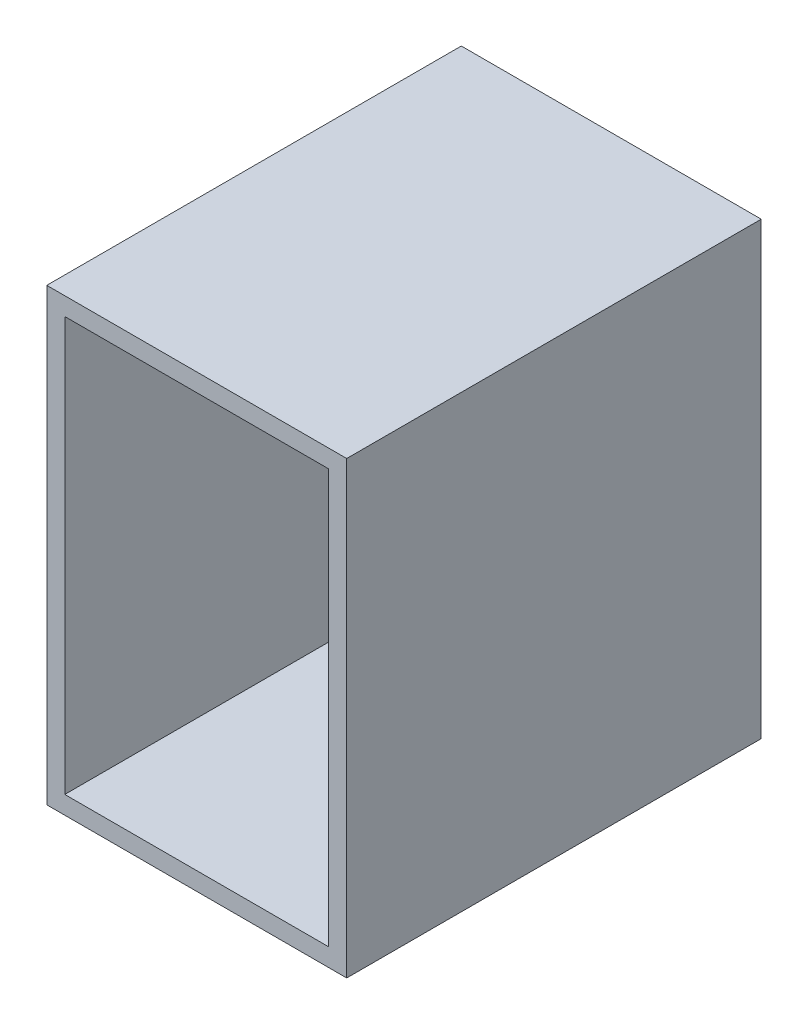
ISO-10303-21;
HEADER;
FILE_DESCRIPTION(('STEP AP214'),'2;1');
FILE_NAME('part.step','',(''),(''),'','','');
FILE_SCHEMA(('AUTOMOTIVE_DESIGN { 1 0 10303 214 1 1 1 1 }'));
ENDSEC;
DATA;
#1=APPLICATION_CONTEXT('core data for automotive mechanical design processes');
#2=APPLICATION_PROTOCOL_DEFINITION('international standard','automotive_design',2000,#1);
#3=PRODUCT_CONTEXT('',#1,'mechanical');
#4=PRODUCT('Part','Part','',(#3));
#5=PRODUCT_RELATED_PRODUCT_CATEGORY('part','',(#4));
#6=PRODUCT_DEFINITION_FORMATION('','',#4);
#7=PRODUCT_DEFINITION_CONTEXT('part definition',#1,'design');
#8=PRODUCT_DEFINITION('design','',#6,#7);
#9=PRODUCT_DEFINITION_SHAPE('','',#8);
#10=(LENGTH_UNIT() NAMED_UNIT(*) SI_UNIT(.MILLI.,.METRE.));
#11=(NAMED_UNIT(*) PLANE_ANGLE_UNIT() SI_UNIT($,.RADIAN.));
#12=(NAMED_UNIT(*) SI_UNIT($,.STERADIAN.) SOLID_ANGLE_UNIT());
#13=UNCERTAINTY_MEASURE_WITH_UNIT(LENGTH_MEASURE(1.E-05),#10,'distance_accuracy_value','');
#14=(GEOMETRIC_REPRESENTATION_CONTEXT(3) GLOBAL_UNCERTAINTY_ASSIGNED_CONTEXT((#13)) GLOBAL_UNIT_ASSIGNED_CONTEXT((#10,
#11,#12)) REPRESENTATION_CONTEXT('',''));
#15=CARTESIAN_POINT('',(0.,0.,0.));
#16=DIRECTION('',(0.,0.,1.));
#17=DIRECTION('',(1.,0.,0.));
#18=AXIS2_PLACEMENT_3D('',#15,#16,#17);
#19=CARTESIAN_POINT('',(0.,0.,138.202315188089));
#20=DIRECTION('',(0.,0.,-1.));
#21=DIRECTION('',(-1.,0.,0.));
#22=AXIS2_PLACEMENT_3D('',#19,#20,#21);
#23=PLANE('',#22);
#24=DIRECTION('',(0.,-1.,0.));
#25=VECTOR('',#24,1.);
#26=CARTESIAN_POINT('',(-50.,-75.,138.202315188089));
#27=LINE('',#26,#25);
#28=CARTESIAN_POINT('',(-50.,74.9999999999999,138.202315188089));
#29=VERTEX_POINT('',#28);
#30=CARTESIAN_POINT('',(-50.,-75.,138.202315188089));
#31=VERTEX_POINT('',#30);
#32=EDGE_CURVE('E138',#29,#31,#27,.T.);
#33=ORIENTED_EDGE('',*,*,#32,.T.);
#34=DIRECTION('',(1.,0.,0.));
#35=VECTOR('',#34,1.);
#36=CARTESIAN_POINT('',(-50.,-75.,138.202315188089));
#37=LINE('',#36,#35);
#38=CARTESIAN_POINT('',(50.,-75.,138.202315188089));
#39=VERTEX_POINT('',#38);
#40=EDGE_CURVE('E141',#31,#39,#37,.T.);
#41=ORIENTED_EDGE('',*,*,#40,.T.);
#42=DIRECTION('',(0.,1.,0.));
#43=VECTOR('',#42,1.);
#44=CARTESIAN_POINT('',(50.,-75.,138.202315188089));
#45=LINE('',#44,#43);
#46=CARTESIAN_POINT('',(50.,75.,138.202315188089));
#47=VERTEX_POINT('',#46);
#48=EDGE_CURVE('E148',#39,#47,#45,.T.);
#49=ORIENTED_EDGE('',*,*,#48,.T.);
#50=DIRECTION('',(-1.,0.,0.));
#51=VECTOR('',#50,1.);
#52=CARTESIAN_POINT('',(-50.,74.9999999999999,138.202315188089));
#53=LINE('',#52,#51);
#54=EDGE_CURVE('E146',#47,#29,#53,.T.);
#55=ORIENTED_EDGE('',*,*,#54,.T.);
#56=EDGE_LOOP('',(#33,#41,#49,#55));
#57=FACE_BOUND('',#56,.T.);
#58=DIRECTION('',(0.,-1.,0.));
#59=VECTOR('',#58,1.);
#60=CARTESIAN_POINT('',(-44.,-69.,138.202315188089));
#61=LINE('',#60,#59);
#62=CARTESIAN_POINT('',(-44.,69.,138.202315188089));
#63=VERTEX_POINT('',#62);
#64=CARTESIAN_POINT('',(-44.,-69.,138.202315188089));
#65=VERTEX_POINT('',#64);
#66=EDGE_CURVE('E102',#63,#65,#61,.T.);
#67=ORIENTED_EDGE('',*,*,#66,.F.);
#68=DIRECTION('',(-1.,0.,0.));
#69=VECTOR('',#68,1.);
#70=CARTESIAN_POINT('',(-44.,69.,138.202315188089));
#71=LINE('',#70,#69);
#72=CARTESIAN_POINT('',(44.,69.,138.202315188089));
#73=VERTEX_POINT('',#72);
#74=EDGE_CURVE('E127',#73,#63,#71,.T.);
#75=ORIENTED_EDGE('',*,*,#74,.F.);
#76=DIRECTION('',(0.,1.,0.));
#77=VECTOR('',#76,1.);
#78=CARTESIAN_POINT('',(44.,-69.,138.202315188089));
#79=LINE('',#78,#77);
#80=CARTESIAN_POINT('',(44.,-69.,138.202315188089));
#81=VERTEX_POINT('',#80);
#82=EDGE_CURVE('E121',#81,#73,#79,.T.);
#83=ORIENTED_EDGE('',*,*,#82,.F.);
#84=DIRECTION('',(1.,0.,0.));
#85=VECTOR('',#84,1.);
#86=CARTESIAN_POINT('',(-44.,-69.,138.202315188089));
#87=LINE('',#86,#85);
#88=EDGE_CURVE('E115',#65,#81,#87,.T.);
#89=ORIENTED_EDGE('',*,*,#88,.F.);
#90=EDGE_LOOP('',(#67,#75,#83,#89));
#91=FACE_BOUND('',#90,.T.);
#92=ADVANCED_FACE('F39',(#57,#91),#23,.F.);
#93=CARTESIAN_POINT('',(0.,0.,0.));
#94=DIRECTION('',(0.,0.,-1.));
#95=DIRECTION('',(-1.,0.,0.));
#96=AXIS2_PLACEMENT_3D('',#93,#94,#95);
#97=PLANE('',#96);
#98=DIRECTION('',(0.,-1.,0.));
#99=VECTOR('',#98,1.);
#100=CARTESIAN_POINT('',(-50.,-75.,0.));
#101=LINE('',#100,#99);
#102=CARTESIAN_POINT('',(-50.,74.9999999999999,0.));
#103=VERTEX_POINT('',#102);
#104=CARTESIAN_POINT('',(-50.,-75.,0.));
#105=VERTEX_POINT('',#104);
#106=EDGE_CURVE('E119',#103,#105,#101,.T.);
#107=ORIENTED_EDGE('',*,*,#106,.F.);
#108=DIRECTION('',(-1.,0.,0.));
#109=VECTOR('',#108,1.);
#110=CARTESIAN_POINT('',(-50.,74.9999999999999,0.));
#111=LINE('',#110,#109);
#112=CARTESIAN_POINT('',(50.,75.,0.));
#113=VERTEX_POINT('',#112);
#114=EDGE_CURVE('E145',#113,#103,#111,.T.);
#115=ORIENTED_EDGE('',*,*,#114,.F.);
#116=DIRECTION('',(0.,1.,0.));
#117=VECTOR('',#116,1.);
#118=CARTESIAN_POINT('',(50.,-75.,0.));
#119=LINE('',#118,#117);
#120=CARTESIAN_POINT('',(50.,-75.,0.));
#121=VERTEX_POINT('',#120);
#122=EDGE_CURVE('E154',#121,#113,#119,.T.);
#123=ORIENTED_EDGE('',*,*,#122,.F.);
#124=DIRECTION('',(1.,0.,0.));
#125=VECTOR('',#124,1.);
#126=CARTESIAN_POINT('',(-50.,-75.,0.));
#127=LINE('',#126,#125);
#128=EDGE_CURVE('E153',#105,#121,#127,.T.);
#129=ORIENTED_EDGE('',*,*,#128,.F.);
#130=EDGE_LOOP('',(#107,#115,#123,#129));
#131=FACE_BOUND('',#130,.T.);
#132=DIRECTION('',(-1.,0.,0.));
#133=VECTOR('',#132,1.);
#134=CARTESIAN_POINT('',(-44.,69.,0.));
#135=LINE('',#134,#133);
#136=CARTESIAN_POINT('',(44.,69.,0.));
#137=VERTEX_POINT('',#136);
#138=CARTESIAN_POINT('',(-44.,69.,0.));
#139=VERTEX_POINT('',#138);
#140=EDGE_CURVE('E114',#137,#139,#135,.T.);
#141=ORIENTED_EDGE('',*,*,#140,.T.);
#142=DIRECTION('',(0.,-1.,0.));
#143=VECTOR('',#142,1.);
#144=CARTESIAN_POINT('',(-44.,-69.,0.));
#145=LINE('',#144,#143);
#146=CARTESIAN_POINT('',(-44.,-69.,0.));
#147=VERTEX_POINT('',#146);
#148=EDGE_CURVE('E65',#139,#147,#145,.T.);
#149=ORIENTED_EDGE('',*,*,#148,.T.);
#150=DIRECTION('',(1.,0.,0.));
#151=VECTOR('',#150,1.);
#152=CARTESIAN_POINT('',(-44.,-69.,0.));
#153=LINE('',#152,#151);
#154=CARTESIAN_POINT('',(44.,-69.,0.));
#155=VERTEX_POINT('',#154);
#156=EDGE_CURVE('E118',#147,#155,#153,.T.);
#157=ORIENTED_EDGE('',*,*,#156,.T.);
#158=DIRECTION('',(0.,1.,0.));
#159=VECTOR('',#158,1.);
#160=CARTESIAN_POINT('',(44.,-69.,0.));
#161=LINE('',#160,#159);
#162=EDGE_CURVE('E135',#155,#137,#161,.T.);
#163=ORIENTED_EDGE('',*,*,#162,.T.);
#164=EDGE_LOOP('',(#141,#149,#157,#163));
#165=FACE_BOUND('',#164,.T.);
#166=ADVANCED_FACE('F172',(#131,#165),#97,.T.);
#167=CARTESIAN_POINT('',(-50.,-75.,138.202315188089));
#168=DIRECTION('',(1.,0.,0.));
#169=DIRECTION('',(0.,1.,0.));
#170=AXIS2_PLACEMENT_3D('',#167,#168,#169);
#171=PLANE('',#170);
#172=ORIENTED_EDGE('',*,*,#106,.T.);
#173=DIRECTION('',(0.,0.,-1.));
#174=VECTOR('',#173,1.);
#175=CARTESIAN_POINT('',(-50.,-75.,138.202315188089));
#176=LINE('',#175,#174);
#177=EDGE_CURVE('E11',#31,#105,#176,.T.);
#178=ORIENTED_EDGE('',*,*,#177,.F.);
#179=ORIENTED_EDGE('',*,*,#32,.F.);
#180=DIRECTION('',(0.,0.,-1.));
#181=VECTOR('',#180,1.);
#182=CARTESIAN_POINT('',(-50.,74.9999999999999,138.202315188089));
#183=LINE('',#182,#181);
#184=EDGE_CURVE('E147',#29,#103,#183,.T.);
#185=ORIENTED_EDGE('',*,*,#184,.T.);
#186=EDGE_LOOP('',(#172,#178,#179,#185));
#187=FACE_BOUND('',#186,.T.);
#188=ADVANCED_FACE('F41',(#187),#171,.F.);
#189=CARTESIAN_POINT('',(-50.,-75.,138.202315188089));
#190=DIRECTION('',(0.,1.,0.));
#191=DIRECTION('',(0.,0.,1.));
#192=AXIS2_PLACEMENT_3D('',#189,#190,#191);
#193=PLANE('',#192);
#194=ORIENTED_EDGE('',*,*,#128,.T.);
#195=DIRECTION('',(0.,0.,-1.));
#196=VECTOR('',#195,1.);
#197=CARTESIAN_POINT('',(50.,-75.,138.202315188089));
#198=LINE('',#197,#196);
#199=EDGE_CURVE('E50',#39,#121,#198,.T.);
#200=ORIENTED_EDGE('',*,*,#199,.F.);
#201=ORIENTED_EDGE('',*,*,#40,.F.);
#202=ORIENTED_EDGE('',*,*,#177,.T.);
#203=EDGE_LOOP('',(#194,#200,#201,#202));
#204=FACE_BOUND('',#203,.T.);
#205=ADVANCED_FACE('F181',(#204),#193,.F.);
#206=CARTESIAN_POINT('',(50.,-75.,138.202315188089));
#207=DIRECTION('',(-1.,0.,0.));
#208=DIRECTION('',(0.,-1.,0.));
#209=AXIS2_PLACEMENT_3D('',#206,#207,#208);
#210=PLANE('',#209);
#211=ORIENTED_EDGE('',*,*,#122,.T.);
#212=DIRECTION('',(0.,0.,-1.));
#213=VECTOR('',#212,1.);
#214=CARTESIAN_POINT('',(50.,75.,138.202315188089));
#215=LINE('',#214,#213);
#216=EDGE_CURVE('E159',#47,#113,#215,.T.);
#217=ORIENTED_EDGE('',*,*,#216,.F.);
#218=ORIENTED_EDGE('',*,*,#48,.F.);
#219=ORIENTED_EDGE('',*,*,#199,.T.);
#220=EDGE_LOOP('',(#211,#217,#218,#219));
#221=FACE_BOUND('',#220,.T.);
#222=ADVANCED_FACE('F170',(#221),#210,.F.);
#223=CARTESIAN_POINT('',(-50.,74.9999999999999,138.202315188089));
#224=DIRECTION('',(0.,-1.,0.));
#225=DIRECTION('',(1.,0.,0.));
#226=AXIS2_PLACEMENT_3D('',#223,#224,#225);
#227=PLANE('',#226);
#228=ORIENTED_EDGE('',*,*,#114,.T.);
#229=ORIENTED_EDGE('',*,*,#184,.F.);
#230=ORIENTED_EDGE('',*,*,#54,.F.);
#231=ORIENTED_EDGE('',*,*,#216,.T.);
#232=EDGE_LOOP('',(#228,#229,#230,#231));
#233=FACE_BOUND('',#232,.T.);
#234=ADVANCED_FACE('F180',(#233),#227,.F.);
#235=CARTESIAN_POINT('',(-44.,-69.,138.202315188089));
#236=DIRECTION('',(1.,0.,0.));
#237=DIRECTION('',(0.,0.,-1.));
#238=AXIS2_PLACEMENT_3D('',#235,#236,#237);
#239=PLANE('',#238);
#240=ORIENTED_EDGE('',*,*,#148,.F.);
#241=DIRECTION('',(0.,0.,-1.));
#242=VECTOR('',#241,1.);
#243=CARTESIAN_POINT('',(-44.,69.,138.202315188089));
#244=LINE('',#243,#242);
#245=EDGE_CURVE('E107',#63,#139,#244,.T.);
#246=ORIENTED_EDGE('',*,*,#245,.F.);
#247=ORIENTED_EDGE('',*,*,#66,.T.);
#248=DIRECTION('',(0.,0.,-1.));
#249=VECTOR('',#248,1.);
#250=CARTESIAN_POINT('',(-44.,-69.,138.202315188089));
#251=LINE('',#250,#249);
#252=EDGE_CURVE('E110',#65,#147,#251,.T.);
#253=ORIENTED_EDGE('',*,*,#252,.T.);
#254=EDGE_LOOP('',(#240,#246,#247,#253));
#255=FACE_BOUND('',#254,.T.);
#256=ADVANCED_FACE('F106',(#255),#239,.T.);
#257=CARTESIAN_POINT('',(-44.,-69.,138.202315188089));
#258=DIRECTION('',(0.,1.,0.));
#259=DIRECTION('',(0.,0.,1.));
#260=AXIS2_PLACEMENT_3D('',#257,#258,#259);
#261=PLANE('',#260);
#262=ORIENTED_EDGE('',*,*,#156,.F.);
#263=ORIENTED_EDGE('',*,*,#252,.F.);
#264=ORIENTED_EDGE('',*,*,#88,.T.);
#265=DIRECTION('',(0.,0.,-1.));
#266=VECTOR('',#265,1.);
#267=CARTESIAN_POINT('',(44.,-69.,138.202315188089));
#268=LINE('',#267,#266);
#269=EDGE_CURVE('E122',#81,#155,#268,.T.);
#270=ORIENTED_EDGE('',*,*,#269,.T.);
#271=EDGE_LOOP('',(#262,#263,#264,#270));
#272=FACE_BOUND('',#271,.T.);
#273=ADVANCED_FACE('F116',(#272),#261,.T.);
#274=CARTESIAN_POINT('',(44.,-69.,138.202315188089));
#275=DIRECTION('',(-1.,0.,0.));
#276=DIRECTION('',(0.,0.,1.));
#277=AXIS2_PLACEMENT_3D('',#274,#275,#276);
#278=PLANE('',#277);
#279=ORIENTED_EDGE('',*,*,#162,.F.);
#280=ORIENTED_EDGE('',*,*,#269,.F.);
#281=ORIENTED_EDGE('',*,*,#82,.T.);
#282=DIRECTION('',(0.,0.,-1.));
#283=VECTOR('',#282,1.);
#284=CARTESIAN_POINT('',(44.,69.,138.202315188089));
#285=LINE('',#284,#283);
#286=EDGE_CURVE('E53',#73,#137,#285,.T.);
#287=ORIENTED_EDGE('',*,*,#286,.T.);
#288=EDGE_LOOP('',(#279,#280,#281,#287));
#289=FACE_BOUND('',#288,.T.);
#290=ADVANCED_FACE('F206',(#289),#278,.T.);
#291=CARTESIAN_POINT('',(-44.,69.,138.202315188089));
#292=DIRECTION('',(0.,-1.,0.));
#293=DIRECTION('',(0.,0.,-1.));
#294=AXIS2_PLACEMENT_3D('',#291,#292,#293);
#295=PLANE('',#294);
#296=ORIENTED_EDGE('',*,*,#140,.F.);
#297=ORIENTED_EDGE('',*,*,#286,.F.);
#298=ORIENTED_EDGE('',*,*,#74,.T.);
#299=ORIENTED_EDGE('',*,*,#245,.T.);
#300=EDGE_LOOP('',(#296,#297,#298,#299));
#301=FACE_BOUND('',#300,.T.);
#302=ADVANCED_FACE('F209',(#301),#295,.T.);
#303=CLOSED_SHELL('',(#92,#166,#188,#205,#222,#234,#256,#273,#290,#302));
#304=MANIFOLD_SOLID_BREP('B2',#303);
#305=ADVANCED_BREP_SHAPE_REPRESENTATION('',(#18,#304),#14);
#306=SHAPE_DEFINITION_REPRESENTATION(#9,#305);
ENDSEC;
END-ISO-10303-21;
